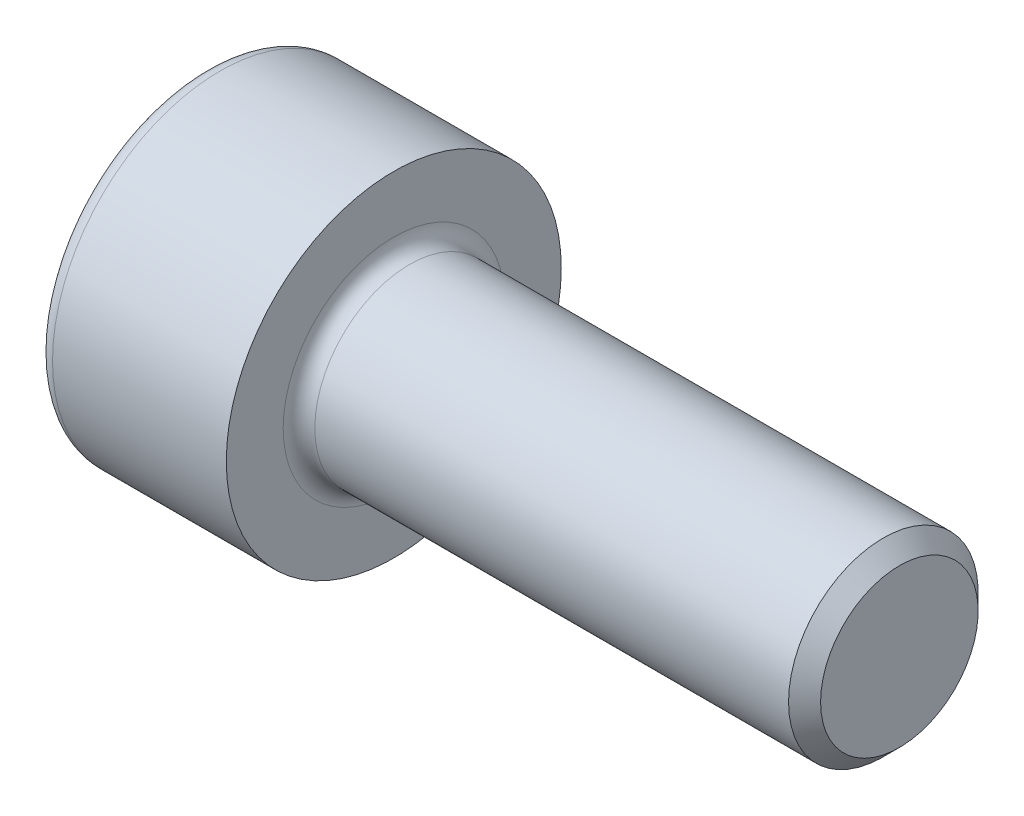
ISO-10303-21;
HEADER;
FILE_DESCRIPTION(('STEP AP214'),'2;1');
FILE_NAME('part.step','',(''),(''),'','','');
FILE_SCHEMA(('AUTOMOTIVE_DESIGN { 1 0 10303 214 1 1 1 1 }'));
ENDSEC;
DATA;
#1=APPLICATION_CONTEXT('core data for automotive mechanical design processes');
#2=APPLICATION_PROTOCOL_DEFINITION('international standard','automotive_design',2000,#1);
#3=PRODUCT_CONTEXT('',#1,'mechanical');
#4=PRODUCT('Part','Part','',(#3));
#5=PRODUCT_RELATED_PRODUCT_CATEGORY('part','',(#4));
#6=PRODUCT_DEFINITION_FORMATION('','',#4);
#7=PRODUCT_DEFINITION_CONTEXT('part definition',#1,'design');
#8=PRODUCT_DEFINITION('design','',#6,#7);
#9=PRODUCT_DEFINITION_SHAPE('','',#8);
#10=(LENGTH_UNIT() NAMED_UNIT(*) SI_UNIT(.MILLI.,.METRE.));
#11=(NAMED_UNIT(*) PLANE_ANGLE_UNIT() SI_UNIT($,.RADIAN.));
#12=(NAMED_UNIT(*) SI_UNIT($,.STERADIAN.) SOLID_ANGLE_UNIT());
#13=UNCERTAINTY_MEASURE_WITH_UNIT(LENGTH_MEASURE(1.E-05),#10,'distance_accuracy_value','');
#14=(GEOMETRIC_REPRESENTATION_CONTEXT(3) GLOBAL_UNCERTAINTY_ASSIGNED_CONTEXT((#13)) GLOBAL_UNIT_ASSIGNED_CONTEXT((#10,
#11,#12)) REPRESENTATION_CONTEXT('',''));
#15=CARTESIAN_POINT('',(0.,0.,0.));
#16=DIRECTION('',(0.,0.,1.));
#17=DIRECTION('',(1.,0.,0.));
#18=AXIS2_PLACEMENT_3D('',#15,#16,#17);
#19=CARTESIAN_POINT('',(8.,0.,0.));
#20=DIRECTION('',(-1.,0.,0.));
#21=DIRECTION('',(0.,0.,1.));
#22=AXIS2_PLACEMENT_3D('',#19,#20,#21);
#23=CONICAL_SURFACE('',#22,1.2464999999935,0.785398163397452);
#24=CARTESIAN_POINT('',(7.7464999999935,0.,0.));
#25=DIRECTION('',(-1.,0.,0.));
#26=DIRECTION('',(0.,0.,1.));
#27=AXIS2_PLACEMENT_3D('',#24,#25,#26);
#28=CIRCLE('',#27,1.5);
#29=CARTESIAN_POINT('',(7.7464999999935,0.,1.5));
#30=VERTEX_POINT('',#29);
#31=EDGE_CURVE('E11',#30,#30,#28,.T.);
#32=ORIENTED_EDGE('',*,*,#31,.F.);
#33=EDGE_LOOP('',(#32));
#34=FACE_BOUND('',#33,.T.);
#35=CARTESIAN_POINT('',(8.,0.,0.));
#36=DIRECTION('',(-1.,0.,0.));
#37=DIRECTION('',(0.,0.,1.));
#38=AXIS2_PLACEMENT_3D('',#35,#36,#37);
#39=CIRCLE('',#38,1.2464999999935);
#40=CARTESIAN_POINT('',(8.,0.,1.2464999999935));
#41=VERTEX_POINT('',#40);
#42=EDGE_CURVE('E134',#41,#41,#39,.T.);
#43=ORIENTED_EDGE('',*,*,#42,.T.);
#44=EDGE_LOOP('',(#43));
#45=FACE_BOUND('',#44,.T.);
#46=ADVANCED_FACE('F33',(#34,#45),#23,.T.);
#47=CARTESIAN_POINT('',(-3.,0.,0.));
#48=DIRECTION('',(-1.,0.,0.));
#49=DIRECTION('',(0.,0.,1.));
#50=AXIS2_PLACEMENT_3D('',#47,#48,#49);
#51=CYLINDRICAL_SURFACE('',#50,1.5);
#52=CARTESIAN_POINT('',(0.25,0.,0.));
#53=DIRECTION('',(-1.,0.,0.));
#54=DIRECTION('',(0.,0.,1.));
#55=AXIS2_PLACEMENT_3D('',#52,#53,#54);
#56=CIRCLE('',#55,1.5);
#57=CARTESIAN_POINT('',(0.25,0.,1.5));
#58=VERTEX_POINT('',#57);
#59=EDGE_CURVE('E40',#58,#58,#56,.T.);
#60=ORIENTED_EDGE('',*,*,#59,.F.);
#61=EDGE_LOOP('',(#60));
#62=FACE_BOUND('',#61,.T.);
#63=ORIENTED_EDGE('',*,*,#31,.T.);
#64=EDGE_LOOP('',(#63));
#65=FACE_BOUND('',#64,.T.);
#66=ADVANCED_FACE('F158',(#62,#65),#51,.T.);
#67=CARTESIAN_POINT('',(0.25,0.,0.));
#68=DIRECTION('',(-1.,0.,0.));
#69=DIRECTION('',(0.,0.,1.));
#70=AXIS2_PLACEMENT_3D('',#67,#68,#69);
#71=TOROIDAL_SURFACE('',#70,1.75,0.25);
#72=CARTESIAN_POINT('',(0.,0.,0.));
#73=DIRECTION('',(-1.,0.,0.));
#74=DIRECTION('',(0.,0.,1.));
#75=AXIS2_PLACEMENT_3D('',#72,#73,#74);
#76=CIRCLE('',#75,1.75);
#77=CARTESIAN_POINT('',(0.,0.,1.75));
#78=VERTEX_POINT('',#77);
#79=EDGE_CURVE('E151',#78,#78,#76,.T.);
#80=ORIENTED_EDGE('',*,*,#79,.F.);
#81=EDGE_LOOP('',(#80));
#82=FACE_BOUND('',#81,.T.);
#83=ORIENTED_EDGE('',*,*,#59,.T.);
#84=EDGE_LOOP('',(#83));
#85=FACE_BOUND('',#84,.T.);
#86=ADVANCED_FACE('F156',(#82,#85),#71,.F.);
#87=CARTESIAN_POINT('',(0.,1.75,0.));
#88=DIRECTION('',(-1.,0.,0.));
#89=DIRECTION('',(0.,0.,1.));
#90=AXIS2_PLACEMENT_3D('',#87,#88,#89);
#91=PLANE('',#90);
#92=CARTESIAN_POINT('',(0.,0.,0.));
#93=DIRECTION('',(-1.,0.,0.));
#94=DIRECTION('',(0.,0.,1.));
#95=AXIS2_PLACEMENT_3D('',#92,#93,#94);
#96=CIRCLE('',#95,2.65);
#97=CARTESIAN_POINT('',(0.,0.,2.65));
#98=VERTEX_POINT('',#97);
#99=EDGE_CURVE('E148',#98,#98,#96,.T.);
#100=ORIENTED_EDGE('',*,*,#99,.F.);
#101=EDGE_LOOP('',(#100));
#102=FACE_BOUND('',#101,.T.);
#103=ORIENTED_EDGE('',*,*,#79,.T.);
#104=EDGE_LOOP('',(#103));
#105=FACE_BOUND('',#104,.T.);
#106=ADVANCED_FACE('F189',(#102,#105),#91,.F.);
#107=CARTESIAN_POINT('',(-3.,0.,0.));
#108=DIRECTION('',(-1.,0.,0.));
#109=DIRECTION('',(0.,0.,1.));
#110=AXIS2_PLACEMENT_3D('',#107,#108,#109);
#111=CYLINDRICAL_SURFACE('',#110,2.65);
#112=CARTESIAN_POINT('',(-2.75,0.,0.));
#113=DIRECTION('',(-1.,0.,0.));
#114=DIRECTION('',(0.,0.,1.));
#115=AXIS2_PLACEMENT_3D('',#112,#113,#114);
#116=CIRCLE('',#115,2.65);
#117=CARTESIAN_POINT('',(-2.75,0.,2.65));
#118=VERTEX_POINT('',#117);
#119=EDGE_CURVE('E145',#118,#118,#116,.T.);
#120=ORIENTED_EDGE('',*,*,#119,.F.);
#121=EDGE_LOOP('',(#120));
#122=FACE_BOUND('',#121,.T.);
#123=ORIENTED_EDGE('',*,*,#99,.T.);
#124=EDGE_LOOP('',(#123));
#125=FACE_BOUND('',#124,.T.);
#126=ADVANCED_FACE('F185',(#122,#125),#111,.T.);
#127=CARTESIAN_POINT('',(-2.75,0.,0.));
#128=DIRECTION('',(-1.,0.,0.));
#129=DIRECTION('',(0.,0.,1.));
#130=AXIS2_PLACEMENT_3D('',#127,#128,#129);
#131=TOROIDAL_SURFACE('',#130,2.4,0.25);
#132=CARTESIAN_POINT('',(-3.,0.,0.));
#133=DIRECTION('',(-1.,0.,0.));
#134=DIRECTION('',(0.,0.,1.));
#135=AXIS2_PLACEMENT_3D('',#132,#133,#134);
#136=CIRCLE('',#135,2.4);
#137=CARTESIAN_POINT('',(-3.,0.,2.4));
#138=VERTEX_POINT('',#137);
#139=EDGE_CURVE('E142',#138,#138,#136,.T.);
#140=ORIENTED_EDGE('',*,*,#139,.F.);
#141=EDGE_LOOP('',(#140));
#142=FACE_BOUND('',#141,.T.);
#143=ORIENTED_EDGE('',*,*,#119,.T.);
#144=EDGE_LOOP('',(#143));
#145=FACE_BOUND('',#144,.T.);
#146=ADVANCED_FACE('F178',(#142,#145),#131,.T.);
#147=CARTESIAN_POINT('',(-3.,2.4,0.));
#148=DIRECTION('',(1.,0.,0.));
#149=DIRECTION('',(0.,0.,-1.));
#150=AXIS2_PLACEMENT_3D('',#147,#148,#149);
#151=PLANE('',#150);
#152=DIRECTION('',(0.,0.5,-0.866025403784439));
#153=VECTOR('',#152,1.);
#154=CARTESIAN_POINT('',(-3.,0.721687836487032,1.25));
#155=LINE('',#154,#153);
#156=CARTESIAN_POINT('',(-3.,0.721687836487032,1.25));
#157=VERTEX_POINT('',#156);
#158=CARTESIAN_POINT('',(-3.,1.44337567297406,0.));
#159=VERTEX_POINT('',#158);
#160=EDGE_CURVE('E121',#157,#159,#155,.T.);
#161=ORIENTED_EDGE('',*,*,#160,.F.);
#162=DIRECTION('',(0.,1.,0.));
#163=VECTOR('',#162,1.);
#164=CARTESIAN_POINT('',(-3.,-0.721687836487033,1.25));
#165=LINE('',#164,#163);
#166=CARTESIAN_POINT('',(-3.,-0.721687836487033,1.25));
#167=VERTEX_POINT('',#166);
#168=EDGE_CURVE('E47',#167,#157,#165,.T.);
#169=ORIENTED_EDGE('',*,*,#168,.F.);
#170=DIRECTION('',(0.,0.5,0.866025403784439));
#171=VECTOR('',#170,1.);
#172=CARTESIAN_POINT('',(-3.,-1.44337567297406,0.));
#173=LINE('',#172,#171);
#174=CARTESIAN_POINT('',(-3.,-1.44337567297406,0.));
#175=VERTEX_POINT('',#174);
#176=EDGE_CURVE('E130',#175,#167,#173,.T.);
#177=ORIENTED_EDGE('',*,*,#176,.F.);
#178=DIRECTION('',(0.,-0.5,0.866025403784439));
#179=VECTOR('',#178,1.);
#180=CARTESIAN_POINT('',(-3.,-0.721687836487032,-1.25));
#181=LINE('',#180,#179);
#182=CARTESIAN_POINT('',(-3.,-0.721687836487032,-1.25));
#183=VERTEX_POINT('',#182);
#184=EDGE_CURVE('E128',#183,#175,#181,.T.);
#185=ORIENTED_EDGE('',*,*,#184,.F.);
#186=DIRECTION('',(0.,-1.,0.));
#187=VECTOR('',#186,1.);
#188=CARTESIAN_POINT('',(-3.,0.721687836487033,-1.25));
#189=LINE('',#188,#187);
#190=CARTESIAN_POINT('',(-3.,0.721687836487033,-1.25));
#191=VERTEX_POINT('',#190);
#192=EDGE_CURVE('E95',#191,#183,#189,.T.);
#193=ORIENTED_EDGE('',*,*,#192,.F.);
#194=DIRECTION('',(0.,-0.5,-0.866025403784439));
#195=VECTOR('',#194,1.);
#196=CARTESIAN_POINT('',(-3.,1.44337567297406,0.));
#197=LINE('',#196,#195);
#198=EDGE_CURVE('E124',#159,#191,#197,.T.);
#199=ORIENTED_EDGE('',*,*,#198,.F.);
#200=EDGE_LOOP('',(#161,#169,#177,#185,#193,#199));
#201=FACE_BOUND('',#200,.T.);
#202=ORIENTED_EDGE('',*,*,#139,.T.);
#203=EDGE_LOOP('',(#202));
#204=FACE_BOUND('',#203,.T.);
#205=ADVANCED_FACE('F170',(#201,#204),#151,.F.);
#206=CARTESIAN_POINT('',(8.,1.2464999999935,0.));
#207=DIRECTION('',(-1.,0.,0.));
#208=DIRECTION('',(0.,0.,1.));
#209=AXIS2_PLACEMENT_3D('',#206,#207,#208);
#210=PLANE('',#209);
#211=ORIENTED_EDGE('',*,*,#42,.F.);
#212=EDGE_LOOP('',(#211));
#213=FACE_BOUND('',#212,.T.);
#214=ADVANCED_FACE('F167',(#213),#210,.F.);
#215=CARTESIAN_POINT('',(-1.9,-0.721687836487033,1.25));
#216=DIRECTION('',(0.,0.,1.));
#217=DIRECTION('',(1.,0.,0.));
#218=AXIS2_PLACEMENT_3D('',#215,#216,#217);
#219=PLANE('',#218);
#220=ORIENTED_EDGE('',*,*,#168,.T.);
#221=DIRECTION('',(-1.,0.,0.));
#222=VECTOR('',#221,1.);
#223=CARTESIAN_POINT('',(-1.9,0.721687836487032,1.25));
#224=LINE('',#223,#222);
#225=CARTESIAN_POINT('',(-1.9,0.721687836487032,1.25));
#226=VERTEX_POINT('',#225);
#227=EDGE_CURVE('E77',#226,#157,#224,.T.);
#228=ORIENTED_EDGE('',*,*,#227,.F.);
#229=DIRECTION('',(0.,1.,0.));
#230=VECTOR('',#229,1.);
#231=CARTESIAN_POINT('',(-1.9,-0.721687836487033,1.25));
#232=LINE('',#231,#230);
#233=CARTESIAN_POINT('',(-1.9,-0.721687836487033,1.25));
#234=VERTEX_POINT('',#233);
#235=EDGE_CURVE('E132',#234,#226,#232,.T.);
#236=ORIENTED_EDGE('',*,*,#235,.F.);
#237=DIRECTION('',(-1.,0.,0.));
#238=VECTOR('',#237,1.);
#239=CARTESIAN_POINT('',(-1.9,-0.721687836487033,1.25));
#240=LINE('',#239,#238);
#241=EDGE_CURVE('E55',#234,#167,#240,.T.);
#242=ORIENTED_EDGE('',*,*,#241,.T.);
#243=EDGE_LOOP('',(#220,#228,#236,#242));
#244=FACE_BOUND('',#243,.T.);
#245=ADVANCED_FACE('F169',(#244),#219,.F.);
#246=CARTESIAN_POINT('',(-1.9,-1.44337567297406,0.));
#247=DIRECTION('',(0.,-0.866025403784439,0.5));
#248=DIRECTION('',(0.,-0.5,-0.866025403784439));
#249=AXIS2_PLACEMENT_3D('',#246,#247,#248);
#250=PLANE('',#249);
#251=ORIENTED_EDGE('',*,*,#176,.T.);
#252=ORIENTED_EDGE('',*,*,#241,.F.);
#253=DIRECTION('',(0.,0.5,0.866025403784439));
#254=VECTOR('',#253,1.);
#255=CARTESIAN_POINT('',(-1.9,-1.44337567297406,0.));
#256=LINE('',#255,#254);
#257=CARTESIAN_POINT('',(-1.9,-1.44337567297406,0.));
#258=VERTEX_POINT('',#257);
#259=EDGE_CURVE('E107',#258,#234,#256,.T.);
#260=ORIENTED_EDGE('',*,*,#259,.F.);
#261=DIRECTION('',(-1.,0.,0.));
#262=VECTOR('',#261,1.);
#263=CARTESIAN_POINT('',(-1.9,-1.44337567297406,0.));
#264=LINE('',#263,#262);
#265=EDGE_CURVE('E99',#258,#175,#264,.T.);
#266=ORIENTED_EDGE('',*,*,#265,.T.);
#267=EDGE_LOOP('',(#251,#252,#260,#266));
#268=FACE_BOUND('',#267,.T.);
#269=ADVANCED_FACE('F176',(#268),#250,.F.);
#270=CARTESIAN_POINT('',(-1.9,-0.721687836487032,-1.25));
#271=DIRECTION('',(0.,-0.866025403784439,-0.5));
#272=DIRECTION('',(0.,0.5,-0.866025403784439));
#273=AXIS2_PLACEMENT_3D('',#270,#271,#272);
#274=PLANE('',#273);
#275=ORIENTED_EDGE('',*,*,#184,.T.);
#276=ORIENTED_EDGE('',*,*,#265,.F.);
#277=DIRECTION('',(0.,-0.5,0.866025403784439));
#278=VECTOR('',#277,1.);
#279=CARTESIAN_POINT('',(-1.9,-0.721687836487032,-1.25));
#280=LINE('',#279,#278);
#281=CARTESIAN_POINT('',(-1.9,-0.721687836487032,-1.25));
#282=VERTEX_POINT('',#281);
#283=EDGE_CURVE('E103',#282,#258,#280,.T.);
#284=ORIENTED_EDGE('',*,*,#283,.F.);
#285=DIRECTION('',(-1.,0.,0.));
#286=VECTOR('',#285,1.);
#287=CARTESIAN_POINT('',(-1.9,-0.721687836487032,-1.25));
#288=LINE('',#287,#286);
#289=EDGE_CURVE('E88',#282,#183,#288,.T.);
#290=ORIENTED_EDGE('',*,*,#289,.T.);
#291=EDGE_LOOP('',(#275,#276,#284,#290));
#292=FACE_BOUND('',#291,.T.);
#293=ADVANCED_FACE('F104',(#292),#274,.F.);
#294=CARTESIAN_POINT('',(-1.9,0.721687836487033,-1.25));
#295=DIRECTION('',(0.,0.,-1.));
#296=DIRECTION('',(-1.,0.,0.));
#297=AXIS2_PLACEMENT_3D('',#294,#295,#296);
#298=PLANE('',#297);
#299=ORIENTED_EDGE('',*,*,#192,.T.);
#300=ORIENTED_EDGE('',*,*,#289,.F.);
#301=DIRECTION('',(0.,-1.,0.));
#302=VECTOR('',#301,1.);
#303=CARTESIAN_POINT('',(-1.9,0.721687836487033,-1.25));
#304=LINE('',#303,#302);
#305=CARTESIAN_POINT('',(-1.9,0.721687836487033,-1.25));
#306=VERTEX_POINT('',#305);
#307=EDGE_CURVE('E92',#306,#282,#304,.T.);
#308=ORIENTED_EDGE('',*,*,#307,.F.);
#309=DIRECTION('',(-1.,0.,0.));
#310=VECTOR('',#309,1.);
#311=CARTESIAN_POINT('',(-1.9,0.721687836487033,-1.25));
#312=LINE('',#311,#310);
#313=EDGE_CURVE('E100',#306,#191,#312,.T.);
#314=ORIENTED_EDGE('',*,*,#313,.T.);
#315=EDGE_LOOP('',(#299,#300,#308,#314));
#316=FACE_BOUND('',#315,.T.);
#317=ADVANCED_FACE('F90',(#316),#298,.F.);
#318=CARTESIAN_POINT('',(-1.9,1.44337567297406,0.));
#319=DIRECTION('',(0.,0.866025403784439,-0.5));
#320=DIRECTION('',(0.,0.5,0.866025403784439));
#321=AXIS2_PLACEMENT_3D('',#318,#319,#320);
#322=PLANE('',#321);
#323=ORIENTED_EDGE('',*,*,#198,.T.);
#324=ORIENTED_EDGE('',*,*,#313,.F.);
#325=DIRECTION('',(0.,-0.5,-0.866025403784439));
#326=VECTOR('',#325,1.);
#327=CARTESIAN_POINT('',(-1.9,1.44337567297406,0.));
#328=LINE('',#327,#326);
#329=CARTESIAN_POINT('',(-1.9,1.44337567297406,0.));
#330=VERTEX_POINT('',#329);
#331=EDGE_CURVE('E113',#330,#306,#328,.T.);
#332=ORIENTED_EDGE('',*,*,#331,.F.);
#333=DIRECTION('',(-1.,0.,0.));
#334=VECTOR('',#333,1.);
#335=CARTESIAN_POINT('',(-1.9,1.44337567297406,0.));
#336=LINE('',#335,#334);
#337=EDGE_CURVE('E137',#330,#159,#336,.T.);
#338=ORIENTED_EDGE('',*,*,#337,.T.);
#339=EDGE_LOOP('',(#323,#324,#332,#338));
#340=FACE_BOUND('',#339,.T.);
#341=ADVANCED_FACE('F251',(#340),#322,.F.);
#342=CARTESIAN_POINT('',(-1.9,0.721687836487032,1.25));
#343=DIRECTION('',(0.,0.866025403784439,0.5));
#344=DIRECTION('',(0.,-0.5,0.866025403784439));
#345=AXIS2_PLACEMENT_3D('',#342,#343,#344);
#346=PLANE('',#345);
#347=ORIENTED_EDGE('',*,*,#160,.T.);
#348=ORIENTED_EDGE('',*,*,#337,.F.);
#349=DIRECTION('',(0.,0.5,-0.866025403784439));
#350=VECTOR('',#349,1.);
#351=CARTESIAN_POINT('',(-1.9,0.721687836487032,1.25));
#352=LINE('',#351,#350);
#353=EDGE_CURVE('E115',#226,#330,#352,.T.);
#354=ORIENTED_EDGE('',*,*,#353,.F.);
#355=ORIENTED_EDGE('',*,*,#227,.T.);
#356=EDGE_LOOP('',(#347,#348,#354,#355));
#357=FACE_BOUND('',#356,.T.);
#358=ADVANCED_FACE('F260',(#357),#346,.F.);
#359=CARTESIAN_POINT('',(-1.9,0.,0.));
#360=DIRECTION('',(-1.,0.,0.));
#361=DIRECTION('',(0.,0.,1.));
#362=AXIS2_PLACEMENT_3D('',#359,#360,#361);
#363=PLANE('',#362);
#364=ORIENTED_EDGE('',*,*,#235,.T.);
#365=ORIENTED_EDGE('',*,*,#353,.T.);
#366=ORIENTED_EDGE('',*,*,#331,.T.);
#367=ORIENTED_EDGE('',*,*,#307,.T.);
#368=ORIENTED_EDGE('',*,*,#283,.T.);
#369=ORIENTED_EDGE('',*,*,#259,.T.);
#370=EDGE_LOOP('',(#364,#365,#366,#367,#368,#369));
#371=FACE_BOUND('',#370,.T.);
#372=ADVANCED_FACE('F110',(#371),#363,.T.);
#373=CLOSED_SHELL('',(#46,#66,#86,#106,#126,#146,#205,#214,#245,#269,#293,#317,#341,#358,#372));
#374=MANIFOLD_SOLID_BREP('B2',#373);
#375=ADVANCED_BREP_SHAPE_REPRESENTATION('',(#18,#374),#14);
#376=SHAPE_DEFINITION_REPRESENTATION(#9,#375);
ENDSEC;
END-ISO-10303-21;
